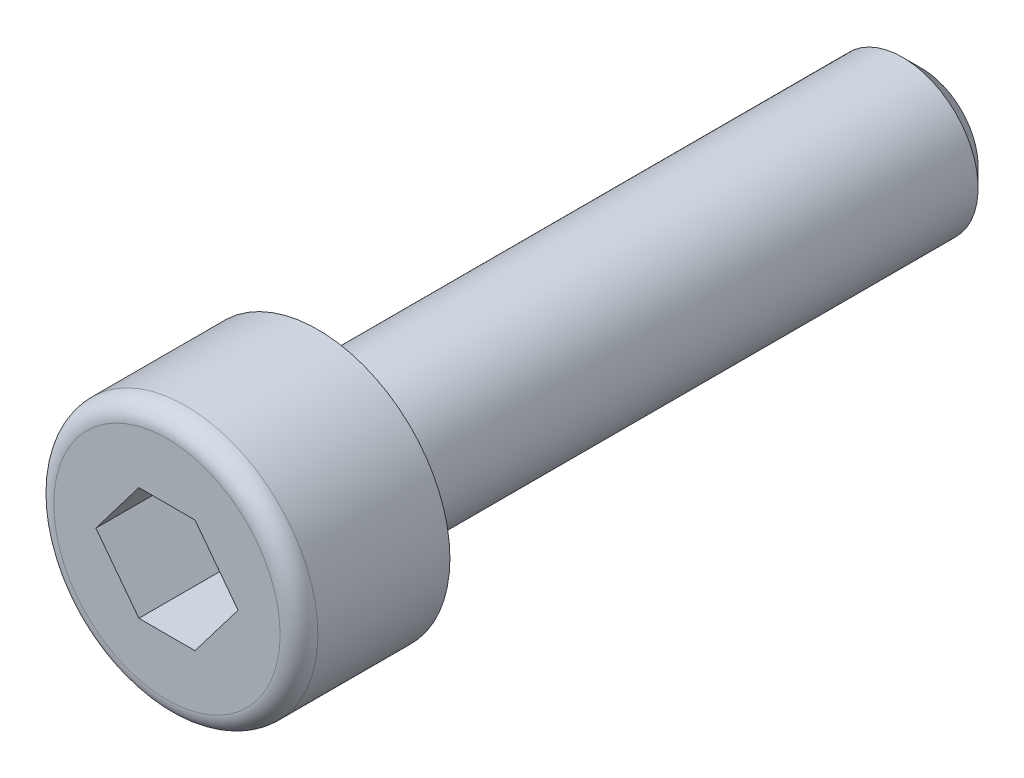
ISO-10303-21;
HEADER;
FILE_DESCRIPTION(('STEP AP214'),'2;1');
FILE_NAME('part.step','',(''),(''),'','','');
FILE_SCHEMA(('AUTOMOTIVE_DESIGN { 1 0 10303 214 1 1 1 1 }'));
ENDSEC;
DATA;
#1=APPLICATION_CONTEXT('core data for automotive mechanical design processes');
#2=APPLICATION_PROTOCOL_DEFINITION('international standard','automotive_design',2000,#1);
#3=PRODUCT_CONTEXT('',#1,'mechanical');
#4=PRODUCT('Part','Part','',(#3));
#5=PRODUCT_RELATED_PRODUCT_CATEGORY('part','',(#4));
#6=PRODUCT_DEFINITION_FORMATION('','',#4);
#7=PRODUCT_DEFINITION_CONTEXT('part definition',#1,'design');
#8=PRODUCT_DEFINITION('design','',#6,#7);
#9=PRODUCT_DEFINITION_SHAPE('','',#8);
#10=(LENGTH_UNIT() NAMED_UNIT(*) SI_UNIT(.MILLI.,.METRE.));
#11=(NAMED_UNIT(*) PLANE_ANGLE_UNIT() SI_UNIT($,.RADIAN.));
#12=(NAMED_UNIT(*) SI_UNIT($,.STERADIAN.) SOLID_ANGLE_UNIT());
#13=UNCERTAINTY_MEASURE_WITH_UNIT(LENGTH_MEASURE(1.E-05),#10,'distance_accuracy_value','');
#14=(GEOMETRIC_REPRESENTATION_CONTEXT(3) GLOBAL_UNCERTAINTY_ASSIGNED_CONTEXT((#13)) GLOBAL_UNIT_ASSIGNED_CONTEXT((#10,
#11,#12)) REPRESENTATION_CONTEXT('',''));
#15=CARTESIAN_POINT('',(0.,0.,0.));
#16=DIRECTION('',(0.,0.,1.));
#17=DIRECTION('',(1.,0.,0.));
#18=AXIS2_PLACEMENT_3D('',#15,#16,#17);
#19=CARTESIAN_POINT('',(0.,0.,0.));
#20=DIRECTION('',(0.,0.,1.));
#21=DIRECTION('',(1.,0.,0.));
#22=AXIS2_PLACEMENT_3D('',#19,#20,#21);
#23=PLANE('',#22);
#24=CARTESIAN_POINT('',(0.,0.,0.));
#25=DIRECTION('',(0.,0.,1.));
#26=DIRECTION('',(1.,0.,0.));
#27=AXIS2_PLACEMENT_3D('',#24,#25,#26);
#28=CIRCLE('',#27,3.5);
#29=CARTESIAN_POINT('',(3.50000000000001,0.,0.));
#30=VERTEX_POINT('',#29);
#31=EDGE_CURVE('E142',#30,#30,#28,.T.);
#32=ORIENTED_EDGE('',*,*,#31,.F.);
#33=EDGE_LOOP('',(#32));
#34=FACE_BOUND('',#33,.T.);
#35=CARTESIAN_POINT('',(0.,0.,0.));
#36=DIRECTION('',(0.,0.,-1.));
#37=DIRECTION('',(-1.,0.,0.));
#38=AXIS2_PLACEMENT_3D('',#35,#36,#37);
#39=CIRCLE('',#38,2.);
#40=CARTESIAN_POINT('',(-2.00000000000001,0.,0.));
#41=VERTEX_POINT('',#40);
#42=EDGE_CURVE('E143',#41,#41,#39,.T.);
#43=ORIENTED_EDGE('',*,*,#42,.F.);
#44=EDGE_LOOP('',(#43));
#45=FACE_BOUND('',#44,.T.);
#46=ADVANCED_FACE('F34',(#34,#45),#23,.F.);
#47=CARTESIAN_POINT('',(0.,0.,4.));
#48=DIRECTION('',(0.,0.,-1.));
#49=DIRECTION('',(-1.,0.,0.));
#50=AXIS2_PLACEMENT_3D('',#47,#48,#49);
#51=CYLINDRICAL_SURFACE('',#50,3.5);
#52=CARTESIAN_POINT('',(0.,0.,3.5));
#53=DIRECTION('',(0.,0.,1.));
#54=DIRECTION('',(1.,0.,0.));
#55=AXIS2_PLACEMENT_3D('',#52,#53,#54);
#56=CIRCLE('',#55,3.5);
#57=CARTESIAN_POINT('',(3.50000000000001,0.,3.5));
#58=VERTEX_POINT('',#57);
#59=EDGE_CURVE('E151',#58,#58,#56,.F.);
#60=ORIENTED_EDGE('',*,*,#59,.T.);
#61=EDGE_LOOP('',(#60));
#62=FACE_BOUND('',#61,.T.);
#63=ORIENTED_EDGE('',*,*,#31,.T.);
#64=EDGE_LOOP('',(#63));
#65=FACE_BOUND('',#64,.T.);
#66=ADVANCED_FACE('F36',(#62,#65),#51,.T.);
#67=CARTESIAN_POINT('',(0.,0.,4.));
#68=DIRECTION('',(0.,0.,1.));
#69=DIRECTION('',(1.,0.,0.));
#70=AXIS2_PLACEMENT_3D('',#67,#68,#69);
#71=PLANE('',#70);
#72=CARTESIAN_POINT('',(0.,0.,4.));
#73=DIRECTION('',(0.,0.,1.));
#74=DIRECTION('',(1.,0.,0.));
#75=AXIS2_PLACEMENT_3D('',#72,#73,#74);
#76=CIRCLE('',#75,3.);
#77=CARTESIAN_POINT('',(3.00000000000001,0.,4.));
#78=VERTEX_POINT('',#77);
#79=EDGE_CURVE('E146',#78,#78,#76,.T.);
#80=ORIENTED_EDGE('',*,*,#79,.T.);
#81=EDGE_LOOP('',(#80));
#82=FACE_BOUND('',#81,.T.);
#83=DIRECTION('',(0.605083267533578,0.796162194123093,0.));
#84=VECTOR('',#83,1.);
#85=CARTESIAN_POINT('',(0.74403821617287,-1.49999999999997,4.));
#86=LINE('',#85,#84);
#87=CARTESIAN_POINT('',(0.74403821617287,-1.49999999999997,4.));
#88=VERTEX_POINT('',#87);
#89=CARTESIAN_POINT('',(1.88403821617277,0.,4.));
#90=VERTEX_POINT('',#89);
#91=EDGE_CURVE('E49',#88,#90,#86,.T.);
#92=ORIENTED_EDGE('',*,*,#91,.F.);
#93=DIRECTION('',(1.,0.,0.));
#94=VECTOR('',#93,1.);
#95=CARTESIAN_POINT('',(-0.744038216172926,-1.49999999999983,4.));
#96=LINE('',#95,#94);
#97=CARTESIAN_POINT('',(-0.744038216172926,-1.49999999999983,4.));
#98=VERTEX_POINT('',#97);
#99=EDGE_CURVE('E118',#98,#88,#96,.T.);
#100=ORIENTED_EDGE('',*,*,#99,.F.);
#101=DIRECTION('',(0.605083267533576,-0.796162194123092,0.));
#102=VECTOR('',#101,1.);
#103=CARTESIAN_POINT('',(-1.88403821617307,0.,4.));
#104=LINE('',#103,#102);
#105=CARTESIAN_POINT('',(-1.88403821617307,0.,4.));
#106=VERTEX_POINT('',#105);
#107=EDGE_CURVE('E112',#106,#98,#104,.T.);
#108=ORIENTED_EDGE('',*,*,#107,.F.);
#109=DIRECTION('',(-0.605083267533578,-0.796162194123093,0.));
#110=VECTOR('',#109,1.);
#111=CARTESIAN_POINT('',(-0.74403821617303,1.50000000000025,3.99999999999992));
#112=LINE('',#111,#110);
#113=CARTESIAN_POINT('',(-0.74403821617303,1.50000000000025,3.99999999999992));
#114=VERTEX_POINT('',#113);
#115=EDGE_CURVE('E110',#114,#106,#112,.T.);
#116=ORIENTED_EDGE('',*,*,#115,.F.);
#117=DIRECTION('',(-1.,0.,0.));
#118=VECTOR('',#117,1.);
#119=CARTESIAN_POINT('',(0.744038216172745,1.50000000000019,3.99999999999992));
#120=LINE('',#119,#118);
#121=CARTESIAN_POINT('',(0.744038216172745,1.50000000000019,3.99999999999992));
#122=VERTEX_POINT('',#121);
#123=EDGE_CURVE('E92',#122,#114,#120,.T.);
#124=ORIENTED_EDGE('',*,*,#123,.F.);
#125=DIRECTION('',(-0.605083267533576,0.796162194123092,0.));
#126=VECTOR('',#125,1.);
#127=CARTESIAN_POINT('',(1.88403821617277,0.,4.));
#128=LINE('',#127,#126);
#129=EDGE_CURVE('E103',#90,#122,#128,.T.);
#130=ORIENTED_EDGE('',*,*,#129,.F.);
#131=EDGE_LOOP('',(#92,#100,#108,#116,#124,#130));
#132=FACE_BOUND('',#131,.T.);
#133=ADVANCED_FACE('F107',(#82,#132),#71,.T.);
#134=CARTESIAN_POINT('',(0.,0.,-16.0000000000001));
#135=DIRECTION('',(0.,0.,1.));
#136=DIRECTION('',(1.,0.,0.));
#137=AXIS2_PLACEMENT_3D('',#134,#135,#136);
#138=CYLINDRICAL_SURFACE('',#137,2.);
#139=CARTESIAN_POINT('',(0.,0.,-15.5000000000001));
#140=DIRECTION('',(0.,0.,-1.));
#141=DIRECTION('',(-1.,0.,0.));
#142=AXIS2_PLACEMENT_3D('',#139,#140,#141);
#143=CIRCLE('',#142,2.);
#144=CARTESIAN_POINT('',(-2.00000000000001,0.,-15.5000000000001));
#145=VERTEX_POINT('',#144);
#146=EDGE_CURVE('E11',#145,#145,#143,.F.);
#147=ORIENTED_EDGE('',*,*,#146,.T.);
#148=EDGE_LOOP('',(#147));
#149=FACE_BOUND('',#148,.T.);
#150=ORIENTED_EDGE('',*,*,#42,.T.);
#151=EDGE_LOOP('',(#150));
#152=FACE_BOUND('',#151,.T.);
#153=ADVANCED_FACE('F181',(#149,#152),#138,.T.);
#154=CARTESIAN_POINT('',(0.,0.,-16.0000000000001));
#155=DIRECTION('',(0.,0.,-1.));
#156=DIRECTION('',(-1.,0.,0.));
#157=AXIS2_PLACEMENT_3D('',#154,#155,#156);
#158=PLANE('',#157);
#159=CARTESIAN_POINT('',(0.,0.,-16.0000000000001));
#160=DIRECTION('',(0.,0.,-1.));
#161=DIRECTION('',(-1.,0.,0.));
#162=AXIS2_PLACEMENT_3D('',#159,#160,#161);
#163=CIRCLE('',#162,1.49999999999999);
#164=CARTESIAN_POINT('',(-1.5,0.,-16.0000000000001));
#165=VERTEX_POINT('',#164);
#166=EDGE_CURVE('E42',#165,#165,#163,.T.);
#167=ORIENTED_EDGE('',*,*,#166,.T.);
#168=EDGE_LOOP('',(#167));
#169=FACE_BOUND('',#168,.T.);
#170=ADVANCED_FACE('F156',(#169),#158,.T.);
#171=CARTESIAN_POINT('',(0.744038216172856,-1.49999999999993,0.));
#172=DIRECTION('',(0.796162194123092,-0.605083267533576,0.));
#173=DIRECTION('',(0.605083267533579,0.796162194123094,0.));
#174=AXIS2_PLACEMENT_3D('',#171,#172,#173);
#175=PLANE('',#174);
#176=DIRECTION('',(0.,0.,1.));
#177=VECTOR('',#176,1.);
#178=CARTESIAN_POINT('',(0.744038216172856,-1.49999999999993,0.));
#179=LINE('',#178,#177);
#180=CARTESIAN_POINT('',(0.744038216172856,-1.49999999999993,0.));
#181=VERTEX_POINT('',#180);
#182=EDGE_CURVE('E56',#181,#88,#179,.T.);
#183=ORIENTED_EDGE('',*,*,#182,.T.);
#184=ORIENTED_EDGE('',*,*,#91,.T.);
#185=DIRECTION('',(0.,0.,1.));
#186=VECTOR('',#185,1.);
#187=CARTESIAN_POINT('',(1.88403821617279,0.,0.));
#188=LINE('',#187,#186);
#189=CARTESIAN_POINT('',(1.88403821617279,0.,0.));
#190=VERTEX_POINT('',#189);
#191=EDGE_CURVE('E100',#190,#90,#188,.T.);
#192=ORIENTED_EDGE('',*,*,#191,.F.);
#193=DIRECTION('',(0.605083267533578,0.796162194123093,0.));
#194=VECTOR('',#193,1.);
#195=CARTESIAN_POINT('',(0.744038216172856,-1.49999999999993,0.));
#196=LINE('',#195,#194);
#197=EDGE_CURVE('E120',#181,#190,#196,.T.);
#198=ORIENTED_EDGE('',*,*,#197,.F.);
#199=EDGE_LOOP('',(#183,#184,#192,#198));
#200=FACE_BOUND('',#199,.T.);
#201=ADVANCED_FACE('F187',(#200),#175,.F.);
#202=CARTESIAN_POINT('',(-0.744038216173037,-1.49999999999983,0.));
#203=DIRECTION('',(0.,-1.,0.));
#204=DIRECTION('',(0.,0.,-1.));
#205=AXIS2_PLACEMENT_3D('',#202,#203,#204);
#206=PLANE('',#205);
#207=DIRECTION('',(0.,0.,1.));
#208=VECTOR('',#207,1.);
#209=CARTESIAN_POINT('',(-0.744038216173037,-1.49999999999983,0.));
#210=LINE('',#209,#208);
#211=CARTESIAN_POINT('',(-0.744038216173037,-1.49999999999983,0.));
#212=VERTEX_POINT('',#211);
#213=EDGE_CURVE('E139',#212,#98,#210,.T.);
#214=ORIENTED_EDGE('',*,*,#213,.T.);
#215=ORIENTED_EDGE('',*,*,#99,.T.);
#216=ORIENTED_EDGE('',*,*,#182,.F.);
#217=DIRECTION('',(1.,0.,0.));
#218=VECTOR('',#217,1.);
#219=CARTESIAN_POINT('',(-0.744038216173037,-1.49999999999983,0.));
#220=LINE('',#219,#218);
#221=EDGE_CURVE('E132',#212,#181,#220,.T.);
#222=ORIENTED_EDGE('',*,*,#221,.F.);
#223=EDGE_LOOP('',(#214,#215,#216,#222));
#224=FACE_BOUND('',#223,.T.);
#225=ADVANCED_FACE('F196',(#224),#206,.F.);
#226=CARTESIAN_POINT('',(-1.88403821617308,0.,0.));
#227=DIRECTION('',(-0.796162194123093,-0.605083267533578,0.));
#228=DIRECTION('',(0.605083267533577,-0.796162194123093,0.));
#229=AXIS2_PLACEMENT_3D('',#226,#227,#228);
#230=PLANE('',#229);
#231=DIRECTION('',(0.,0.,1.));
#232=VECTOR('',#231,1.);
#233=CARTESIAN_POINT('',(-1.88403821617308,0.,0.));
#234=LINE('',#233,#232);
#235=CARTESIAN_POINT('',(-1.88403821617308,0.,0.));
#236=VERTEX_POINT('',#235);
#237=EDGE_CURVE('E137',#236,#106,#234,.T.);
#238=ORIENTED_EDGE('',*,*,#237,.T.);
#239=ORIENTED_EDGE('',*,*,#107,.T.);
#240=ORIENTED_EDGE('',*,*,#213,.F.);
#241=DIRECTION('',(0.605083267533576,-0.796162194123092,0.));
#242=VECTOR('',#241,1.);
#243=CARTESIAN_POINT('',(-1.88403821617308,0.,0.));
#244=LINE('',#243,#242);
#245=EDGE_CURVE('E129',#236,#212,#244,.T.);
#246=ORIENTED_EDGE('',*,*,#245,.F.);
#247=EDGE_LOOP('',(#238,#239,#240,#246));
#248=FACE_BOUND('',#247,.T.);
#249=ADVANCED_FACE('F201',(#248),#230,.F.);
#250=CARTESIAN_POINT('',(-0.744038216173044,1.50000000000025,0.));
#251=DIRECTION('',(-0.796162194123092,0.605083267533576,0.));
#252=DIRECTION('',(-0.605083267533579,-0.796162194123094,0.));
#253=AXIS2_PLACEMENT_3D('',#250,#251,#252);
#254=PLANE('',#253);
#255=DIRECTION('',(0.,0.,1.));
#256=VECTOR('',#255,1.);
#257=CARTESIAN_POINT('',(-0.744038216173044,1.50000000000025,0.));
#258=LINE('',#257,#256);
#259=CARTESIAN_POINT('',(-0.744038216173044,1.50000000000025,0.));
#260=VERTEX_POINT('',#259);
#261=EDGE_CURVE('E99',#260,#114,#258,.T.);
#262=ORIENTED_EDGE('',*,*,#261,.T.);
#263=ORIENTED_EDGE('',*,*,#115,.T.);
#264=ORIENTED_EDGE('',*,*,#237,.F.);
#265=DIRECTION('',(-0.605083267533578,-0.796162194123093,0.));
#266=VECTOR('',#265,1.);
#267=CARTESIAN_POINT('',(-0.744038216173044,1.50000000000025,0.));
#268=LINE('',#267,#266);
#269=EDGE_CURVE('E126',#260,#236,#268,.T.);
#270=ORIENTED_EDGE('',*,*,#269,.F.);
#271=EDGE_LOOP('',(#262,#263,#264,#270));
#272=FACE_BOUND('',#271,.T.);
#273=ADVANCED_FACE('F209',(#272),#254,.F.);
#274=CARTESIAN_POINT('',(0.744038216172738,1.5000000000002,0.));
#275=DIRECTION('',(0.,1.,0.));
#276=DIRECTION('',(0.,0.,1.));
#277=AXIS2_PLACEMENT_3D('',#274,#275,#276);
#278=PLANE('',#277);
#279=DIRECTION('',(0.,0.,1.));
#280=VECTOR('',#279,1.);
#281=CARTESIAN_POINT('',(0.744038216172738,1.5000000000002,0.));
#282=LINE('',#281,#280);
#283=CARTESIAN_POINT('',(0.744038216172738,1.5000000000002,0.));
#284=VERTEX_POINT('',#283);
#285=EDGE_CURVE('E88',#284,#122,#282,.T.);
#286=ORIENTED_EDGE('',*,*,#285,.T.);
#287=ORIENTED_EDGE('',*,*,#123,.T.);
#288=ORIENTED_EDGE('',*,*,#261,.F.);
#289=DIRECTION('',(-1.,0.,0.));
#290=VECTOR('',#289,1.);
#291=CARTESIAN_POINT('',(0.744038216172738,1.5000000000002,0.));
#292=LINE('',#291,#290);
#293=EDGE_CURVE('E95',#284,#260,#292,.T.);
#294=ORIENTED_EDGE('',*,*,#293,.F.);
#295=EDGE_LOOP('',(#286,#287,#288,#294));
#296=FACE_BOUND('',#295,.T.);
#297=ADVANCED_FACE('F90',(#296),#278,.F.);
#298=CARTESIAN_POINT('',(1.88403821617279,0.,0.));
#299=DIRECTION('',(0.796162194123093,0.605083267533578,0.));
#300=DIRECTION('',(-0.605083267533577,0.796162194123093,0.));
#301=AXIS2_PLACEMENT_3D('',#298,#299,#300);
#302=PLANE('',#301);
#303=DIRECTION('',(-0.605083267533576,0.796162194123092,0.));
#304=VECTOR('',#303,1.);
#305=CARTESIAN_POINT('',(1.88403821617279,0.,0.));
#306=LINE('',#305,#304);
#307=EDGE_CURVE('E123',#190,#284,#306,.T.);
#308=ORIENTED_EDGE('',*,*,#307,.F.);
#309=ORIENTED_EDGE('',*,*,#191,.T.);
#310=ORIENTED_EDGE('',*,*,#129,.T.);
#311=ORIENTED_EDGE('',*,*,#285,.F.);
#312=EDGE_LOOP('',(#308,#309,#310,#311));
#313=FACE_BOUND('',#312,.T.);
#314=ADVANCED_FACE('F104',(#313),#302,.F.);
#315=CARTESIAN_POINT('',(1.88403821617279,0.,0.));
#316=DIRECTION('',(0.,0.,1.));
#317=DIRECTION('',(1.,0.,0.));
#318=AXIS2_PLACEMENT_3D('',#315,#316,#317);
#319=PLANE('',#318);
#320=ORIENTED_EDGE('',*,*,#197,.T.);
#321=ORIENTED_EDGE('',*,*,#307,.T.);
#322=ORIENTED_EDGE('',*,*,#293,.T.);
#323=ORIENTED_EDGE('',*,*,#269,.T.);
#324=ORIENTED_EDGE('',*,*,#245,.T.);
#325=ORIENTED_EDGE('',*,*,#221,.T.);
#326=EDGE_LOOP('',(#320,#321,#322,#323,#324,#325));
#327=FACE_BOUND('',#326,.T.);
#328=ADVANCED_FACE('F166',(#327),#319,.T.);
#329=CARTESIAN_POINT('',(0.,0.,3.5));
#330=DIRECTION('',(0.,0.,1.));
#331=DIRECTION('',(1.,0.,0.));
#332=AXIS2_PLACEMENT_3D('',#329,#330,#331);
#333=TOROIDAL_SURFACE('',#332,3.,0.5);
#334=ORIENTED_EDGE('',*,*,#59,.F.);
#335=EDGE_LOOP('',(#334));
#336=FACE_BOUND('',#335,.T.);
#337=ORIENTED_EDGE('',*,*,#79,.F.);
#338=EDGE_LOOP('',(#337));
#339=FACE_BOUND('',#338,.T.);
#340=ADVANCED_FACE('F160',(#336,#339),#333,.T.);
#341=CARTESIAN_POINT('',(0.,0.,-16.0000000000001));
#342=DIRECTION('',(0.,0.,1.));
#343=DIRECTION('',(1.,0.,0.));
#344=AXIS2_PLACEMENT_3D('',#341,#342,#343);
#345=CONICAL_SURFACE('',#344,1.49999999999999,0.785398163397453);
#346=ORIENTED_EDGE('',*,*,#146,.F.);
#347=EDGE_LOOP('',(#346));
#348=FACE_BOUND('',#347,.T.);
#349=ORIENTED_EDGE('',*,*,#166,.F.);
#350=EDGE_LOOP('',(#349));
#351=FACE_BOUND('',#350,.T.);
#352=ADVANCED_FACE('F158',(#348,#351),#345,.T.);
#353=CLOSED_SHELL('',(#46,#66,#133,#153,#170,#201,#225,#249,#273,#297,#314,#328,#340,#352));
#354=MANIFOLD_SOLID_BREP('B2',#353);
#355=ADVANCED_BREP_SHAPE_REPRESENTATION('',(#18,#354),#14);
#356=SHAPE_DEFINITION_REPRESENTATION(#9,#355);
ENDSEC;
END-ISO-10303-21;
